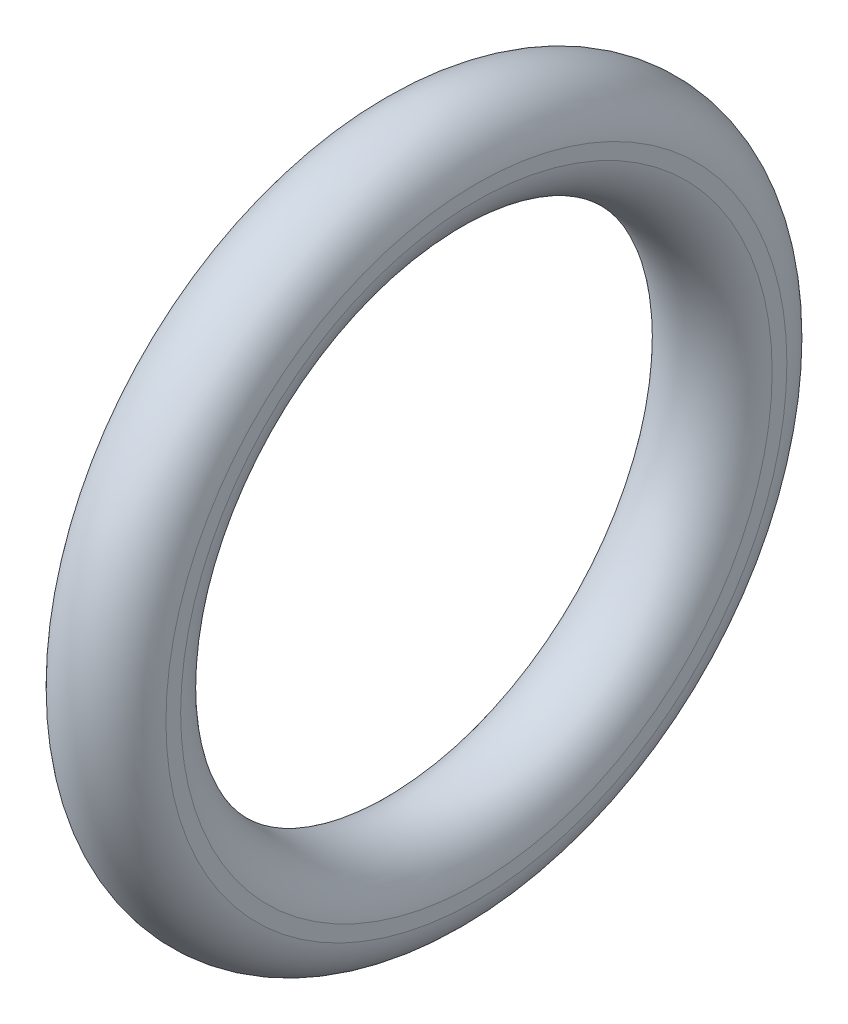
ISO-10303-21;
HEADER;
FILE_DESCRIPTION(('STEP AP214'),'2;1');
FILE_NAME('part.step','',(''),(''),'','','');
FILE_SCHEMA(('AUTOMOTIVE_DESIGN { 1 0 10303 214 1 1 1 1 }'));
ENDSEC;
DATA;
#1=APPLICATION_CONTEXT('core data for automotive mechanical design processes');
#2=APPLICATION_PROTOCOL_DEFINITION('international standard','automotive_design',2000,#1);
#3=PRODUCT_CONTEXT('',#1,'mechanical');
#4=PRODUCT('Part','Part','',(#3));
#5=PRODUCT_RELATED_PRODUCT_CATEGORY('part','',(#4));
#6=PRODUCT_DEFINITION_FORMATION('','',#4);
#7=PRODUCT_DEFINITION_CONTEXT('part definition',#1,'design');
#8=PRODUCT_DEFINITION('design','',#6,#7);
#9=PRODUCT_DEFINITION_SHAPE('','',#8);
#10=(LENGTH_UNIT() NAMED_UNIT(*) SI_UNIT(.MILLI.,.METRE.));
#11=(NAMED_UNIT(*) PLANE_ANGLE_UNIT() SI_UNIT($,.RADIAN.));
#12=(NAMED_UNIT(*) SI_UNIT($,.STERADIAN.) SOLID_ANGLE_UNIT());
#13=UNCERTAINTY_MEASURE_WITH_UNIT(LENGTH_MEASURE(1.E-05),#10,'distance_accuracy_value','');
#14=(GEOMETRIC_REPRESENTATION_CONTEXT(3) GLOBAL_UNCERTAINTY_ASSIGNED_CONTEXT((#13)) GLOBAL_UNIT_ASSIGNED_CONTEXT((#10,
#11,#12)) REPRESENTATION_CONTEXT('',''));
#15=CARTESIAN_POINT('',(0.,0.,0.));
#16=DIRECTION('',(0.,0.,1.));
#17=DIRECTION('',(1.,0.,0.));
#18=AXIS2_PLACEMENT_3D('',#15,#16,#17);
#19=CARTESIAN_POINT('',(0.381,7.67483632750361,0.));
#20=DIRECTION('',(-1.,0.,0.));
#21=DIRECTION('',(0.,0.,1.));
#22=AXIS2_PLACEMENT_3D('',#19,#20,#21);
#23=PLANE('',#22);
#24=CARTESIAN_POINT('',(0.381,0.,0.));
#25=DIRECTION('',(-1.,0.,0.));
#26=DIRECTION('',(0.,0.,1.));
#27=AXIS2_PLACEMENT_3D('',#24,#25,#26);
#28=CIRCLE('',#27,7.31116367249639);
#29=CARTESIAN_POINT('',(0.381,0.,7.31116367249639));
#30=VERTEX_POINT('',#29);
#31=EDGE_CURVE('E54',#30,#30,#28,.T.);
#32=ORIENTED_EDGE('',*,*,#31,.T.);
#33=EDGE_LOOP('',(#32));
#34=FACE_BOUND('',#33,.T.);
#35=CARTESIAN_POINT('',(0.381,0.,0.));
#36=DIRECTION('',(-1.,0.,0.));
#37=DIRECTION('',(0.,0.,1.));
#38=AXIS2_PLACEMENT_3D('',#35,#36,#37);
#39=CIRCLE('',#38,7.67483632750361);
#40=CARTESIAN_POINT('',(0.381,0.,-7.67483632750361));
#41=VERTEX_POINT('',#40);
#42=EDGE_CURVE('E26',#41,#41,#39,.T.);
#43=ORIENTED_EDGE('',*,*,#42,.F.);
#44=EDGE_LOOP('',(#43));
#45=FACE_BOUND('',#44,.T.);
#46=ADVANCED_FACE('F17',(#34,#45),#23,.F.);
#47=CARTESIAN_POINT('',(-2.2098,7.67483632750361,0.));
#48=DIRECTION('',(1.,0.,0.));
#49=DIRECTION('',(0.,1.,0.));
#50=AXIS2_PLACEMENT_3D('',#47,#48,#49);
#51=PLANE('',#50);
#52=CARTESIAN_POINT('',(-2.2098,0.,0.));
#53=DIRECTION('',(-1.,0.,0.));
#54=DIRECTION('',(0.,0.,1.));
#55=AXIS2_PLACEMENT_3D('',#52,#53,#54);
#56=CIRCLE('',#55,7.31116367249639);
#57=CARTESIAN_POINT('',(-2.2098,0.,-7.31116367249639));
#58=VERTEX_POINT('',#57);
#59=EDGE_CURVE('E58',#58,#58,#56,.T.);
#60=ORIENTED_EDGE('',*,*,#59,.F.);
#61=EDGE_LOOP('',(#60));
#62=FACE_BOUND('',#61,.T.);
#63=CARTESIAN_POINT('',(-2.2098,0.,0.));
#64=DIRECTION('',(-1.,0.,0.));
#65=DIRECTION('',(0.,0.,1.));
#66=AXIS2_PLACEMENT_3D('',#63,#64,#65);
#67=CIRCLE('',#66,7.67483632750361);
#68=CARTESIAN_POINT('',(-2.2098,0.,7.67483632750361));
#69=VERTEX_POINT('',#68);
#70=EDGE_CURVE('E11',#69,#69,#67,.T.);
#71=ORIENTED_EDGE('',*,*,#70,.T.);
#72=EDGE_LOOP('',(#71));
#73=FACE_BOUND('',#72,.T.);
#74=ADVANCED_FACE('F19',(#62,#73),#51,.F.);
#75=CARTESIAN_POINT('',(-0.9144,0.,0.));
#76=DIRECTION('',(-1.,0.,0.));
#77=DIRECTION('',(0.,0.,1.));
#78=AXIS2_PLACEMENT_3D('',#75,#76,#77);
#79=TOROIDAL_SURFACE('',#78,7.493,1.3081);
#80=ORIENTED_EDGE('',*,*,#70,.F.);
#81=EDGE_LOOP('',(#80));
#82=FACE_BOUND('',#81,.T.);
#83=ORIENTED_EDGE('',*,*,#42,.T.);
#84=EDGE_LOOP('',(#83));
#85=FACE_BOUND('',#84,.T.);
#86=ADVANCED_FACE('F78',(#82,#85),#79,.T.);
#87=CARTESIAN_POINT('',(-0.9144,0.,0.));
#88=DIRECTION('',(-1.,0.,0.));
#89=DIRECTION('',(0.,0.,1.));
#90=AXIS2_PLACEMENT_3D('',#87,#88,#89);
#91=TOROIDAL_SURFACE('',#90,7.493,1.3081);
#92=ORIENTED_EDGE('',*,*,#59,.T.);
#93=EDGE_LOOP('',(#92));
#94=FACE_BOUND('',#93,.T.);
#95=ORIENTED_EDGE('',*,*,#31,.F.);
#96=EDGE_LOOP('',(#95));
#97=FACE_BOUND('',#96,.T.);
#98=ADVANCED_FACE('F83',(#94,#97),#91,.T.);
#99=CLOSED_SHELL('',(#46,#74,#86,#98));
#100=MANIFOLD_SOLID_BREP('B1',#99);
#101=ADVANCED_BREP_SHAPE_REPRESENTATION('',(#18,#100),#14);
#102=SHAPE_DEFINITION_REPRESENTATION(#9,#101);
ENDSEC;
END-ISO-10303-21;
